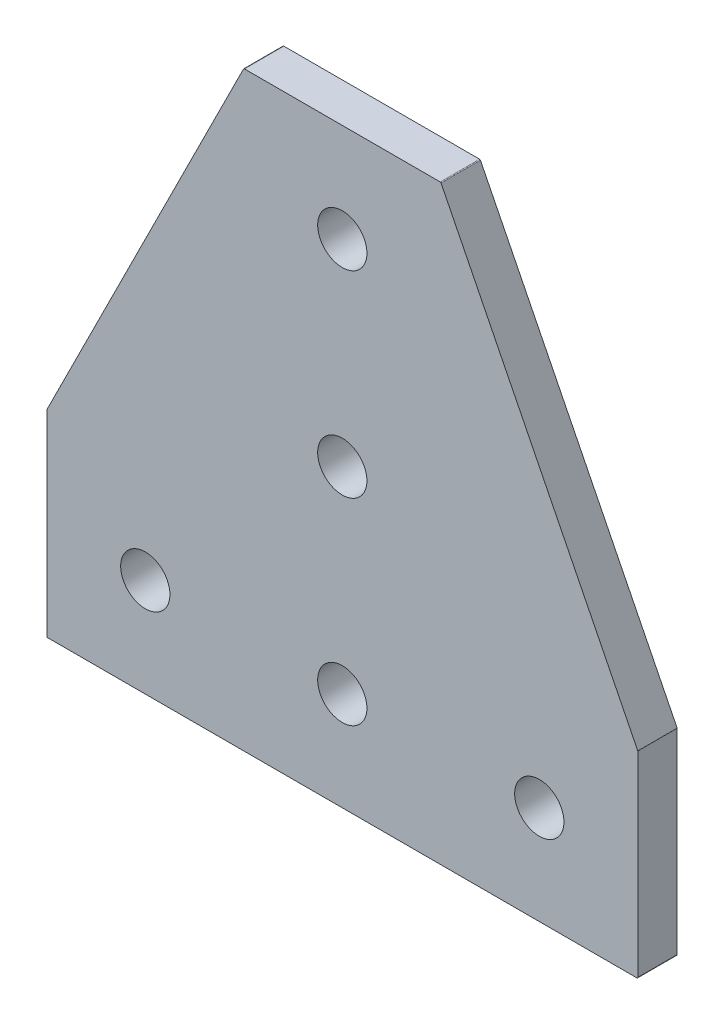
ISO-10303-21;
HEADER;
FILE_DESCRIPTION(('STEP AP214'),'2;1');
FILE_NAME('part.step','',(''),(''),'','','');
FILE_SCHEMA(('AUTOMOTIVE_DESIGN { 1 0 10303 214 1 1 1 1 }'));
ENDSEC;
DATA;
#1=APPLICATION_CONTEXT('core data for automotive mechanical design processes');
#2=APPLICATION_PROTOCOL_DEFINITION('international standard','automotive_design',2000,#1);
#3=PRODUCT_CONTEXT('',#1,'mechanical');
#4=PRODUCT('Part','Part','',(#3));
#5=PRODUCT_RELATED_PRODUCT_CATEGORY('part','',(#4));
#6=PRODUCT_DEFINITION_FORMATION('','',#4);
#7=PRODUCT_DEFINITION_CONTEXT('part definition',#1,'design');
#8=PRODUCT_DEFINITION('design','',#6,#7);
#9=PRODUCT_DEFINITION_SHAPE('','',#8);
#10=(LENGTH_UNIT() NAMED_UNIT(*) SI_UNIT(.MILLI.,.METRE.));
#11=(NAMED_UNIT(*) PLANE_ANGLE_UNIT() SI_UNIT($,.RADIAN.));
#12=(NAMED_UNIT(*) SI_UNIT($,.STERADIAN.) SOLID_ANGLE_UNIT());
#13=UNCERTAINTY_MEASURE_WITH_UNIT(LENGTH_MEASURE(1.E-05),#10,'distance_accuracy_value','');
#14=(GEOMETRIC_REPRESENTATION_CONTEXT(3) GLOBAL_UNCERTAINTY_ASSIGNED_CONTEXT((#13)) GLOBAL_UNIT_ASSIGNED_CONTEXT((#10,
#11,#12)) REPRESENTATION_CONTEXT('',''));
#15=CARTESIAN_POINT('',(0.,0.,0.));
#16=DIRECTION('',(0.,0.,1.));
#17=DIRECTION('',(1.,0.,0.));
#18=AXIS2_PLACEMENT_3D('',#15,#16,#17);
#19=CARTESIAN_POINT('',(0.,0.,-4.));
#20=DIRECTION('',(0.,-1.,0.));
#21=DIRECTION('',(0.,0.,-1.));
#22=AXIS2_PLACEMENT_3D('',#19,#20,#21);
#23=PLANE('',#22);
#24=DIRECTION('',(1.,0.,0.));
#25=VECTOR('',#24,1.);
#26=CARTESIAN_POINT('',(0.,0.,0.));
#27=LINE('',#26,#25);
#28=CARTESIAN_POINT('',(0.1,0.,0.));
#29=VERTEX_POINT('',#28);
#30=CARTESIAN_POINT('',(59.9,0.,0.));
#31=VERTEX_POINT('',#30);
#32=EDGE_CURVE('E213',#29,#31,#27,.T.);
#33=ORIENTED_EDGE('',*,*,#32,.F.);
#34=DIRECTION('',(0.,0.,1.));
#35=VECTOR('',#34,1.);
#36=CARTESIAN_POINT('',(0.1,0.,-4.));
#37=LINE('',#36,#35);
#38=CARTESIAN_POINT('',(0.1,0.,-4.));
#39=VERTEX_POINT('',#38);
#40=EDGE_CURVE('E170',#29,#39,#37,.F.);
#41=ORIENTED_EDGE('',*,*,#40,.T.);
#42=DIRECTION('',(1.,0.,0.));
#43=VECTOR('',#42,1.);
#44=CARTESIAN_POINT('',(0.,0.,-4.));
#45=LINE('',#44,#43);
#46=CARTESIAN_POINT('',(59.9,0.,-4.));
#47=VERTEX_POINT('',#46);
#48=EDGE_CURVE('E146',#39,#47,#45,.T.);
#49=ORIENTED_EDGE('',*,*,#48,.T.);
#50=DIRECTION('',(0.,0.,1.));
#51=VECTOR('',#50,1.);
#52=CARTESIAN_POINT('',(59.9,0.,-4.));
#53=LINE('',#52,#51);
#54=EDGE_CURVE('E167',#47,#31,#53,.T.);
#55=ORIENTED_EDGE('',*,*,#54,.T.);
#56=EDGE_LOOP('',(#33,#41,#49,#55));
#57=FACE_BOUND('',#56,.T.);
#58=ADVANCED_FACE('F34',(#57),#23,.T.);
#59=CARTESIAN_POINT('',(0.,20.,-4.));
#60=DIRECTION('',(-1.,0.,0.));
#61=DIRECTION('',(0.,0.,1.));
#62=AXIS2_PLACEMENT_3D('',#59,#60,#61);
#63=PLANE('',#62);
#64=DIRECTION('',(0.,-1.,0.));
#65=VECTOR('',#64,1.);
#66=CARTESIAN_POINT('',(0.,20.,-4.));
#67=LINE('',#66,#65);
#68=CARTESIAN_POINT('',(0.,19.97639320225,-4.));
#69=VERTEX_POINT('',#68);
#70=CARTESIAN_POINT('',(0.,0.0999999999999994,-4.));
#71=VERTEX_POINT('',#70);
#72=EDGE_CURVE('E218',#69,#71,#67,.T.);
#73=ORIENTED_EDGE('',*,*,#72,.T.);
#74=DIRECTION('',(0.,0.,1.));
#75=VECTOR('',#74,1.);
#76=CARTESIAN_POINT('',(0.,0.0999999999999994,-4.));
#77=LINE('',#76,#75);
#78=CARTESIAN_POINT('',(0.,0.0999999999999994,0.));
#79=VERTEX_POINT('',#78);
#80=EDGE_CURVE('E145',#71,#79,#77,.T.);
#81=ORIENTED_EDGE('',*,*,#80,.T.);
#82=DIRECTION('',(0.,-1.,0.));
#83=VECTOR('',#82,1.);
#84=CARTESIAN_POINT('',(0.,20.,0.));
#85=LINE('',#84,#83);
#86=CARTESIAN_POINT('',(0.,19.97639320225,0.));
#87=VERTEX_POINT('',#86);
#88=EDGE_CURVE('E128',#87,#79,#85,.T.);
#89=ORIENTED_EDGE('',*,*,#88,.F.);
#90=DIRECTION('',(0.,0.,1.));
#91=VECTOR('',#90,1.);
#92=CARTESIAN_POINT('',(0.,19.97639320225,-4.));
#93=LINE('',#92,#91);
#94=EDGE_CURVE('E142',#87,#69,#93,.F.);
#95=ORIENTED_EDGE('',*,*,#94,.T.);
#96=EDGE_LOOP('',(#73,#81,#89,#95));
#97=FACE_BOUND('',#96,.T.);
#98=ADVANCED_FACE('F141',(#97),#63,.T.);
#99=CARTESIAN_POINT('',(20.,60.,-4.));
#100=DIRECTION('',(-0.894427190999916,0.447213595499958,0.));
#101=DIRECTION('',(-0.447213595499958,-0.894427190999916,0.));
#102=AXIS2_PLACEMENT_3D('',#99,#100,#101);
#103=PLANE('',#102);
#104=DIRECTION('',(-0.447213595499958,-0.894427190999916,0.));
#105=VECTOR('',#104,1.);
#106=CARTESIAN_POINT('',(20.,60.,-4.));
#107=LINE('',#106,#105);
#108=CARTESIAN_POINT('',(19.972360679775,59.94472135955,-4.));
#109=VERTEX_POINT('',#108);
#110=CARTESIAN_POINT('',(0.010557280900006,20.0211145618,-4.));
#111=VERTEX_POINT('',#110);
#112=EDGE_CURVE('E221',#109,#111,#107,.T.);
#113=ORIENTED_EDGE('',*,*,#112,.T.);
#114=DIRECTION('',(0.,0.,1.));
#115=VECTOR('',#114,1.);
#116=CARTESIAN_POINT('',(0.0105572809000094,20.0211145618,-4.));
#117=LINE('',#116,#115);
#118=CARTESIAN_POINT('',(0.010557280900006,20.0211145618,0.));
#119=VERTEX_POINT('',#118);
#120=EDGE_CURVE('E184',#111,#119,#117,.T.);
#121=ORIENTED_EDGE('',*,*,#120,.T.);
#122=DIRECTION('',(-0.447213595499958,-0.894427190999916,0.));
#123=VECTOR('',#122,1.);
#124=CARTESIAN_POINT('',(20.,60.,0.));
#125=LINE('',#124,#123);
#126=CARTESIAN_POINT('',(19.972360679775,59.94472135955,0.));
#127=VERTEX_POINT('',#126);
#128=EDGE_CURVE('E130',#127,#119,#125,.T.);
#129=ORIENTED_EDGE('',*,*,#128,.F.);
#130=DIRECTION('',(0.,0.,1.));
#131=VECTOR('',#130,1.);
#132=CARTESIAN_POINT('',(19.972360679775,59.94472135955,-4.));
#133=LINE('',#132,#131);
#134=EDGE_CURVE('E182',#127,#109,#133,.F.);
#135=ORIENTED_EDGE('',*,*,#134,.T.);
#136=EDGE_LOOP('',(#113,#121,#129,#135));
#137=FACE_BOUND('',#136,.T.);
#138=ADVANCED_FACE('F256',(#137),#103,.T.);
#139=CARTESIAN_POINT('',(20.,60.,-4.));
#140=DIRECTION('',(0.,1.,0.));
#141=DIRECTION('',(-1.,0.,0.));
#142=AXIS2_PLACEMENT_3D('',#139,#140,#141);
#143=PLANE('',#142);
#144=DIRECTION('',(-1.,0.,0.));
#145=VECTOR('',#144,1.);
#146=CARTESIAN_POINT('',(20.,60.,-4.));
#147=LINE('',#146,#145);
#148=CARTESIAN_POINT('',(39.938196601125,60.,-4.));
#149=VERTEX_POINT('',#148);
#150=CARTESIAN_POINT('',(20.061803398875,60.,-4.));
#151=VERTEX_POINT('',#150);
#152=EDGE_CURVE('E224',#149,#151,#147,.T.);
#153=ORIENTED_EDGE('',*,*,#152,.T.);
#154=DIRECTION('',(0.,0.,1.));
#155=VECTOR('',#154,1.);
#156=CARTESIAN_POINT('',(20.061803398875,60.,-4.));
#157=LINE('',#156,#155);
#158=CARTESIAN_POINT('',(20.061803398875,60.,0.));
#159=VERTEX_POINT('',#158);
#160=EDGE_CURVE('E188',#151,#159,#157,.T.);
#161=ORIENTED_EDGE('',*,*,#160,.T.);
#162=DIRECTION('',(-1.,0.,0.));
#163=VECTOR('',#162,1.);
#164=CARTESIAN_POINT('',(20.,60.,0.));
#165=LINE('',#164,#163);
#166=CARTESIAN_POINT('',(39.938196601125,60.,0.));
#167=VERTEX_POINT('',#166);
#168=EDGE_CURVE('E209',#167,#159,#165,.T.);
#169=ORIENTED_EDGE('',*,*,#168,.F.);
#170=DIRECTION('',(0.,0.,1.));
#171=VECTOR('',#170,1.);
#172=CARTESIAN_POINT('',(39.938196601125,60.,-4.));
#173=LINE('',#172,#171);
#174=EDGE_CURVE('E186',#167,#149,#173,.F.);
#175=ORIENTED_EDGE('',*,*,#174,.T.);
#176=EDGE_LOOP('',(#153,#161,#169,#175));
#177=FACE_BOUND('',#176,.T.);
#178=ADVANCED_FACE('F249',(#177),#143,.T.);
#179=CARTESIAN_POINT('',(60.,20.,-4.));
#180=DIRECTION('',(0.894427190999916,0.447213595499958,0.));
#181=DIRECTION('',(-0.447213595499958,0.894427190999916,0.));
#182=AXIS2_PLACEMENT_3D('',#179,#180,#181);
#183=PLANE('',#182);
#184=DIRECTION('',(-0.447213595499958,0.894427190999916,0.));
#185=VECTOR('',#184,1.);
#186=CARTESIAN_POINT('',(60.,20.,0.));
#187=LINE('',#186,#185);
#188=CARTESIAN_POINT('',(59.9894427191,20.0211145618,0.));
#189=VERTEX_POINT('',#188);
#190=CARTESIAN_POINT('',(40.027639320225,59.94472135955,0.));
#191=VERTEX_POINT('',#190);
#192=EDGE_CURVE('E201',#189,#191,#187,.T.);
#193=ORIENTED_EDGE('',*,*,#192,.F.);
#194=DIRECTION('',(0.,0.,1.));
#195=VECTOR('',#194,1.);
#196=CARTESIAN_POINT('',(59.9894427191,20.0211145618,-4.));
#197=LINE('',#196,#195);
#198=CARTESIAN_POINT('',(59.9894427191,20.0211145618,-4.));
#199=VERTEX_POINT('',#198);
#200=EDGE_CURVE('E11',#189,#199,#197,.F.);
#201=ORIENTED_EDGE('',*,*,#200,.T.);
#202=DIRECTION('',(-0.447213595499958,0.894427190999916,0.));
#203=VECTOR('',#202,1.);
#204=CARTESIAN_POINT('',(60.,20.,-4.));
#205=LINE('',#204,#203);
#206=CARTESIAN_POINT('',(40.027639320225,59.94472135955,-4.));
#207=VERTEX_POINT('',#206);
#208=EDGE_CURVE('E203',#199,#207,#205,.T.);
#209=ORIENTED_EDGE('',*,*,#208,.T.);
#210=DIRECTION('',(0.,0.,1.));
#211=VECTOR('',#210,1.);
#212=CARTESIAN_POINT('',(40.027639320225,59.94472135955,-4.));
#213=LINE('',#212,#211);
#214=EDGE_CURVE('E42',#207,#191,#213,.T.);
#215=ORIENTED_EDGE('',*,*,#214,.T.);
#216=EDGE_LOOP('',(#193,#201,#209,#215));
#217=FACE_BOUND('',#216,.T.);
#218=ADVANCED_FACE('F200',(#217),#183,.T.);
#219=CARTESIAN_POINT('',(60.,0.,-4.));
#220=DIRECTION('',(1.,0.,0.));
#221=DIRECTION('',(0.,1.,0.));
#222=AXIS2_PLACEMENT_3D('',#219,#220,#221);
#223=PLANE('',#222);
#224=DIRECTION('',(0.,1.,0.));
#225=VECTOR('',#224,1.);
#226=CARTESIAN_POINT('',(60.,0.,0.));
#227=LINE('',#226,#225);
#228=CARTESIAN_POINT('',(60.,0.1,0.));
#229=VERTEX_POINT('',#228);
#230=CARTESIAN_POINT('',(60.,19.97639320225,0.));
#231=VERTEX_POINT('',#230);
#232=EDGE_CURVE('E210',#229,#231,#227,.T.);
#233=ORIENTED_EDGE('',*,*,#232,.F.);
#234=DIRECTION('',(0.,0.,1.));
#235=VECTOR('',#234,1.);
#236=CARTESIAN_POINT('',(60.,0.1,-4.));
#237=LINE('',#236,#235);
#238=CARTESIAN_POINT('',(60.,0.1,-4.));
#239=VERTEX_POINT('',#238);
#240=EDGE_CURVE('E56',#229,#239,#237,.F.);
#241=ORIENTED_EDGE('',*,*,#240,.T.);
#242=DIRECTION('',(0.,1.,0.));
#243=VECTOR('',#242,1.);
#244=CARTESIAN_POINT('',(60.,0.,-4.));
#245=LINE('',#244,#243);
#246=CARTESIAN_POINT('',(60.,19.97639320225,-4.));
#247=VERTEX_POINT('',#246);
#248=EDGE_CURVE('E243',#239,#247,#245,.T.);
#249=ORIENTED_EDGE('',*,*,#248,.T.);
#250=DIRECTION('',(0.,0.,1.));
#251=VECTOR('',#250,1.);
#252=CARTESIAN_POINT('',(60.,19.97639320225,-4.));
#253=LINE('',#252,#251);
#254=EDGE_CURVE('E191',#247,#231,#253,.T.);
#255=ORIENTED_EDGE('',*,*,#254,.T.);
#256=EDGE_LOOP('',(#233,#241,#249,#255));
#257=FACE_BOUND('',#256,.T.);
#258=ADVANCED_FACE('F269',(#257),#223,.T.);
#259=CARTESIAN_POINT('',(0.,0.,-4.));
#260=DIRECTION('',(0.,0.,1.));
#261=DIRECTION('',(1.,0.,0.));
#262=AXIS2_PLACEMENT_3D('',#259,#260,#261);
#263=PLANE('',#262);
#264=CARTESIAN_POINT('',(50.,10.,-4.));
#265=DIRECTION('',(0.,0.,1.));
#266=DIRECTION('',(1.,0.,0.));
#267=AXIS2_PLACEMENT_3D('',#264,#265,#266);
#268=CIRCLE('',#267,2.5);
#269=CARTESIAN_POINT('',(52.5,10.,-4.));
#270=VERTEX_POINT('',#269);
#271=EDGE_CURVE('E438',#270,#270,#268,.T.);
#272=ORIENTED_EDGE('',*,*,#271,.T.);
#273=EDGE_LOOP('',(#272));
#274=FACE_BOUND('',#273,.T.);
#275=CARTESIAN_POINT('',(10.,10.,-4.));
#276=DIRECTION('',(0.,0.,1.));
#277=DIRECTION('',(1.,0.,0.));
#278=AXIS2_PLACEMENT_3D('',#275,#276,#277);
#279=CIRCLE('',#278,2.5);
#280=CARTESIAN_POINT('',(12.5,10.,-4.));
#281=VERTEX_POINT('',#280);
#282=EDGE_CURVE('E442',#281,#281,#279,.T.);
#283=ORIENTED_EDGE('',*,*,#282,.T.);
#284=EDGE_LOOP('',(#283));
#285=FACE_BOUND('',#284,.T.);
#286=CARTESIAN_POINT('',(30.,30.,-4.));
#287=DIRECTION('',(0.,0.,1.));
#288=DIRECTION('',(1.,0.,0.));
#289=AXIS2_PLACEMENT_3D('',#286,#287,#288);
#290=CIRCLE('',#289,2.5);
#291=CARTESIAN_POINT('',(32.5,30.,-4.));
#292=VERTEX_POINT('',#291);
#293=EDGE_CURVE('E445',#292,#292,#290,.T.);
#294=ORIENTED_EDGE('',*,*,#293,.T.);
#295=EDGE_LOOP('',(#294));
#296=FACE_BOUND('',#295,.T.);
#297=CARTESIAN_POINT('',(30.,10.,-4.));
#298=DIRECTION('',(0.,0.,1.));
#299=DIRECTION('',(1.,0.,0.));
#300=AXIS2_PLACEMENT_3D('',#297,#298,#299);
#301=CIRCLE('',#300,2.5);
#302=CARTESIAN_POINT('',(32.5,10.,-4.));
#303=VERTEX_POINT('',#302);
#304=EDGE_CURVE('E228',#303,#303,#301,.T.);
#305=ORIENTED_EDGE('',*,*,#304,.T.);
#306=EDGE_LOOP('',(#305));
#307=FACE_BOUND('',#306,.T.);
#308=ORIENTED_EDGE('',*,*,#48,.F.);
#309=CARTESIAN_POINT('',(0.1,0.0999999999999994,-4.));
#310=DIRECTION('',(0.,0.,1.));
#311=DIRECTION('',(1.,0.,0.));
#312=AXIS2_PLACEMENT_3D('',#309,#310,#311);
#313=CIRCLE('',#312,0.1);
#314=EDGE_CURVE('E180',#39,#71,#313,.F.);
#315=ORIENTED_EDGE('',*,*,#314,.T.);
#316=ORIENTED_EDGE('',*,*,#72,.F.);
#317=CARTESIAN_POINT('',(0.0999999999999994,19.97639320225,-4.));
#318=DIRECTION('',(0.,0.,1.));
#319=DIRECTION('',(1.,0.,0.));
#320=AXIS2_PLACEMENT_3D('',#317,#318,#319);
#321=CIRCLE('',#320,0.1);
#322=EDGE_CURVE('E150',#69,#111,#321,.F.);
#323=ORIENTED_EDGE('',*,*,#322,.T.);
#324=ORIENTED_EDGE('',*,*,#112,.F.);
#325=CARTESIAN_POINT('',(20.061803398875,59.9,-4.));
#326=DIRECTION('',(0.,0.,1.));
#327=DIRECTION('',(1.,0.,0.));
#328=AXIS2_PLACEMENT_3D('',#325,#326,#327);
#329=CIRCLE('',#328,0.1);
#330=EDGE_CURVE('E177',#109,#151,#329,.F.);
#331=ORIENTED_EDGE('',*,*,#330,.T.);
#332=ORIENTED_EDGE('',*,*,#152,.F.);
#333=CARTESIAN_POINT('',(39.938196601125,59.9,-4.));
#334=DIRECTION('',(0.,0.,1.));
#335=DIRECTION('',(1.,0.,0.));
#336=AXIS2_PLACEMENT_3D('',#333,#334,#335);
#337=CIRCLE('',#336,0.1);
#338=EDGE_CURVE('E172',#149,#207,#337,.F.);
#339=ORIENTED_EDGE('',*,*,#338,.T.);
#340=ORIENTED_EDGE('',*,*,#208,.F.);
#341=CARTESIAN_POINT('',(59.9,19.97639320225,-4.));
#342=DIRECTION('',(0.,0.,1.));
#343=DIRECTION('',(1.,0.,0.));
#344=AXIS2_PLACEMENT_3D('',#341,#342,#343);
#345=CIRCLE('',#344,0.1);
#346=EDGE_CURVE('E49',#199,#247,#345,.F.);
#347=ORIENTED_EDGE('',*,*,#346,.T.);
#348=ORIENTED_EDGE('',*,*,#248,.F.);
#349=CARTESIAN_POINT('',(59.9,0.1,-4.));
#350=DIRECTION('',(0.,0.,1.));
#351=DIRECTION('',(1.,0.,0.));
#352=AXIS2_PLACEMENT_3D('',#349,#350,#351);
#353=CIRCLE('',#352,0.1);
#354=EDGE_CURVE('E175',#239,#47,#353,.F.);
#355=ORIENTED_EDGE('',*,*,#354,.T.);
#356=EDGE_LOOP('',(#308,#315,#316,#323,#324,#331,#332,#339,#340,#347,#348,#355));
#357=FACE_BOUND('',#356,.T.);
#358=CARTESIAN_POINT('',(30.,50.,-4.));
#359=DIRECTION('',(0.,0.,1.));
#360=DIRECTION('',(1.,0.,0.));
#361=AXIS2_PLACEMENT_3D('',#358,#359,#360);
#362=CIRCLE('',#361,2.5);
#363=CARTESIAN_POINT('',(32.5,50.,-4.));
#364=VERTEX_POINT('',#363);
#365=EDGE_CURVE('E156',#364,#364,#362,.T.);
#366=ORIENTED_EDGE('',*,*,#365,.T.);
#367=EDGE_LOOP('',(#366));
#368=FACE_BOUND('',#367,.T.);
#369=ADVANCED_FACE('F259',(#274,#285,#296,#307,#357,#368),#263,.F.);
#370=CARTESIAN_POINT('',(0.,0.,0.));
#371=DIRECTION('',(0.,0.,1.));
#372=DIRECTION('',(1.,0.,0.));
#373=AXIS2_PLACEMENT_3D('',#370,#371,#372);
#374=PLANE('',#373);
#375=CARTESIAN_POINT('',(50.,10.,0.));
#376=DIRECTION('',(0.,0.,1.));
#377=DIRECTION('',(1.,0.,0.));
#378=AXIS2_PLACEMENT_3D('',#375,#376,#377);
#379=CIRCLE('',#378,2.5);
#380=CARTESIAN_POINT('',(52.5,10.,0.));
#381=VERTEX_POINT('',#380);
#382=EDGE_CURVE('E452',#381,#381,#379,.T.);
#383=ORIENTED_EDGE('',*,*,#382,.F.);
#384=EDGE_LOOP('',(#383));
#385=FACE_BOUND('',#384,.T.);
#386=CARTESIAN_POINT('',(10.,10.,0.));
#387=DIRECTION('',(0.,0.,1.));
#388=DIRECTION('',(1.,0.,0.));
#389=AXIS2_PLACEMENT_3D('',#386,#387,#388);
#390=CIRCLE('',#389,2.5);
#391=CARTESIAN_POINT('',(12.5,10.,0.));
#392=VERTEX_POINT('',#391);
#393=EDGE_CURVE('E447',#392,#392,#390,.T.);
#394=ORIENTED_EDGE('',*,*,#393,.F.);
#395=EDGE_LOOP('',(#394));
#396=FACE_BOUND('',#395,.T.);
#397=CARTESIAN_POINT('',(30.,30.,0.));
#398=DIRECTION('',(0.,0.,1.));
#399=DIRECTION('',(1.,0.,0.));
#400=AXIS2_PLACEMENT_3D('',#397,#398,#399);
#401=CIRCLE('',#400,2.5);
#402=CARTESIAN_POINT('',(32.5,30.,0.));
#403=VERTEX_POINT('',#402);
#404=EDGE_CURVE('E236',#403,#403,#401,.T.);
#405=ORIENTED_EDGE('',*,*,#404,.F.);
#406=EDGE_LOOP('',(#405));
#407=FACE_BOUND('',#406,.T.);
#408=CARTESIAN_POINT('',(30.,10.,0.));
#409=DIRECTION('',(0.,0.,1.));
#410=DIRECTION('',(1.,0.,0.));
#411=AXIS2_PLACEMENT_3D('',#408,#409,#410);
#412=CIRCLE('',#411,2.5);
#413=CARTESIAN_POINT('',(32.5,10.,0.));
#414=VERTEX_POINT('',#413);
#415=EDGE_CURVE('E231',#414,#414,#412,.T.);
#416=ORIENTED_EDGE('',*,*,#415,.F.);
#417=EDGE_LOOP('',(#416));
#418=FACE_BOUND('',#417,.T.);
#419=ORIENTED_EDGE('',*,*,#88,.T.);
#420=CARTESIAN_POINT('',(0.1,0.0999999999999994,0.));
#421=DIRECTION('',(0.,0.,1.));
#422=DIRECTION('',(1.,0.,0.));
#423=AXIS2_PLACEMENT_3D('',#420,#421,#422);
#424=CIRCLE('',#423,0.1);
#425=EDGE_CURVE('E135',#79,#29,#424,.T.);
#426=ORIENTED_EDGE('',*,*,#425,.T.);
#427=ORIENTED_EDGE('',*,*,#32,.T.);
#428=CARTESIAN_POINT('',(59.9,0.1,0.));
#429=DIRECTION('',(0.,0.,1.));
#430=DIRECTION('',(1.,0.,0.));
#431=AXIS2_PLACEMENT_3D('',#428,#429,#430);
#432=CIRCLE('',#431,0.1);
#433=EDGE_CURVE('E163',#31,#229,#432,.T.);
#434=ORIENTED_EDGE('',*,*,#433,.T.);
#435=ORIENTED_EDGE('',*,*,#232,.T.);
#436=CARTESIAN_POINT('',(59.9,19.97639320225,0.));
#437=DIRECTION('',(0.,0.,1.));
#438=DIRECTION('',(1.,0.,0.));
#439=AXIS2_PLACEMENT_3D('',#436,#437,#438);
#440=CIRCLE('',#439,0.1);
#441=EDGE_CURVE('E161',#231,#189,#440,.T.);
#442=ORIENTED_EDGE('',*,*,#441,.T.);
#443=ORIENTED_EDGE('',*,*,#192,.T.);
#444=CARTESIAN_POINT('',(39.938196601125,59.9,0.));
#445=DIRECTION('',(0.,0.,1.));
#446=DIRECTION('',(1.,0.,0.));
#447=AXIS2_PLACEMENT_3D('',#444,#445,#446);
#448=CIRCLE('',#447,0.1);
#449=EDGE_CURVE('E153',#191,#167,#448,.T.);
#450=ORIENTED_EDGE('',*,*,#449,.T.);
#451=ORIENTED_EDGE('',*,*,#168,.T.);
#452=CARTESIAN_POINT('',(20.061803398875,59.9,0.));
#453=DIRECTION('',(0.,0.,1.));
#454=DIRECTION('',(1.,0.,0.));
#455=AXIS2_PLACEMENT_3D('',#452,#453,#454);
#456=CIRCLE('',#455,0.1);
#457=EDGE_CURVE('E136',#159,#127,#456,.T.);
#458=ORIENTED_EDGE('',*,*,#457,.T.);
#459=ORIENTED_EDGE('',*,*,#128,.T.);
#460=CARTESIAN_POINT('',(0.0999999999999994,19.97639320225,0.));
#461=DIRECTION('',(0.,0.,1.));
#462=DIRECTION('',(1.,0.,0.));
#463=AXIS2_PLACEMENT_3D('',#460,#461,#462);
#464=CIRCLE('',#463,0.1);
#465=EDGE_CURVE('E124',#119,#87,#464,.T.);
#466=ORIENTED_EDGE('',*,*,#465,.T.);
#467=EDGE_LOOP('',(#419,#426,#427,#434,#435,#442,#443,#450,#451,#458,#459,#466));
#468=FACE_BOUND('',#467,.T.);
#469=CARTESIAN_POINT('',(30.,50.,0.));
#470=DIRECTION('',(0.,0.,1.));
#471=DIRECTION('',(1.,0.,0.));
#472=AXIS2_PLACEMENT_3D('',#469,#470,#471);
#473=CIRCLE('',#472,2.5);
#474=CARTESIAN_POINT('',(32.5,50.,0.));
#475=VERTEX_POINT('',#474);
#476=EDGE_CURVE('E151',#475,#475,#473,.T.);
#477=ORIENTED_EDGE('',*,*,#476,.F.);
#478=EDGE_LOOP('',(#477));
#479=FACE_BOUND('',#478,.T.);
#480=ADVANCED_FACE('F126',(#385,#396,#407,#418,#468,#479),#374,.T.);
#481=CARTESIAN_POINT('',(30.,10.,-4.));
#482=DIRECTION('',(0.,0.,1.));
#483=DIRECTION('',(1.,0.,0.));
#484=AXIS2_PLACEMENT_3D('',#481,#482,#483);
#485=CYLINDRICAL_SURFACE('',#484,2.5);
#486=ORIENTED_EDGE('',*,*,#304,.F.);
#487=EDGE_LOOP('',(#486));
#488=FACE_BOUND('',#487,.T.);
#489=ORIENTED_EDGE('',*,*,#415,.T.);
#490=EDGE_LOOP('',(#489));
#491=FACE_BOUND('',#490,.T.);
#492=ADVANCED_FACE('F360',(#488,#491),#485,.F.);
#493=CARTESIAN_POINT('',(30.,30.,-4.));
#494=DIRECTION('',(0.,0.,1.));
#495=DIRECTION('',(1.,0.,0.));
#496=AXIS2_PLACEMENT_3D('',#493,#494,#495);
#497=CYLINDRICAL_SURFACE('',#496,2.5);
#498=ORIENTED_EDGE('',*,*,#293,.F.);
#499=EDGE_LOOP('',(#498));
#500=FACE_BOUND('',#499,.T.);
#501=ORIENTED_EDGE('',*,*,#404,.T.);
#502=EDGE_LOOP('',(#501));
#503=FACE_BOUND('',#502,.T.);
#504=ADVANCED_FACE('F290',(#500,#503),#497,.F.);
#505=CARTESIAN_POINT('',(30.,50.,-4.));
#506=DIRECTION('',(0.,0.,1.));
#507=DIRECTION('',(1.,0.,0.));
#508=AXIS2_PLACEMENT_3D('',#505,#506,#507);
#509=CYLINDRICAL_SURFACE('',#508,2.5);
#510=ORIENTED_EDGE('',*,*,#365,.F.);
#511=EDGE_LOOP('',(#510));
#512=FACE_BOUND('',#511,.T.);
#513=ORIENTED_EDGE('',*,*,#476,.T.);
#514=EDGE_LOOP('',(#513));
#515=FACE_BOUND('',#514,.T.);
#516=ADVANCED_FACE('F286',(#512,#515),#509,.F.);
#517=CARTESIAN_POINT('',(10.,10.,-4.));
#518=DIRECTION('',(0.,0.,1.));
#519=DIRECTION('',(1.,0.,0.));
#520=AXIS2_PLACEMENT_3D('',#517,#518,#519);
#521=CYLINDRICAL_SURFACE('',#520,2.5);
#522=ORIENTED_EDGE('',*,*,#282,.F.);
#523=EDGE_LOOP('',(#522));
#524=FACE_BOUND('',#523,.T.);
#525=ORIENTED_EDGE('',*,*,#393,.T.);
#526=EDGE_LOOP('',(#525));
#527=FACE_BOUND('',#526,.T.);
#528=ADVANCED_FACE('F289',(#524,#527),#521,.F.);
#529=CARTESIAN_POINT('',(50.,10.,-4.));
#530=DIRECTION('',(0.,0.,1.));
#531=DIRECTION('',(1.,0.,0.));
#532=AXIS2_PLACEMENT_3D('',#529,#530,#531);
#533=CYLINDRICAL_SURFACE('',#532,2.5);
#534=ORIENTED_EDGE('',*,*,#271,.F.);
#535=EDGE_LOOP('',(#534));
#536=FACE_BOUND('',#535,.T.);
#537=ORIENTED_EDGE('',*,*,#382,.T.);
#538=EDGE_LOOP('',(#537));
#539=FACE_BOUND('',#538,.T.);
#540=ADVANCED_FACE('F294',(#536,#539),#533,.F.);
#541=CARTESIAN_POINT('',(0.1,0.0999999999999994,-4.));
#542=DIRECTION('',(0.,0.,1.));
#543=DIRECTION('',(1.,0.,0.));
#544=AXIS2_PLACEMENT_3D('',#541,#542,#543);
#545=CYLINDRICAL_SURFACE('',#544,0.1);
#546=ORIENTED_EDGE('',*,*,#314,.F.);
#547=ORIENTED_EDGE('',*,*,#40,.F.);
#548=ORIENTED_EDGE('',*,*,#425,.F.);
#549=ORIENTED_EDGE('',*,*,#80,.F.);
#550=EDGE_LOOP('',(#546,#547,#548,#549));
#551=FACE_BOUND('',#550,.T.);
#552=ADVANCED_FACE('F263',(#551),#545,.T.);
#553=CARTESIAN_POINT('',(0.0999999999999994,19.97639320225,-4.));
#554=DIRECTION('',(0.,0.,1.));
#555=DIRECTION('',(1.,0.,0.));
#556=AXIS2_PLACEMENT_3D('',#553,#554,#555);
#557=CYLINDRICAL_SURFACE('',#556,0.1);
#558=ORIENTED_EDGE('',*,*,#322,.F.);
#559=ORIENTED_EDGE('',*,*,#94,.F.);
#560=ORIENTED_EDGE('',*,*,#465,.F.);
#561=ORIENTED_EDGE('',*,*,#120,.F.);
#562=EDGE_LOOP('',(#558,#559,#560,#561));
#563=FACE_BOUND('',#562,.T.);
#564=ADVANCED_FACE('F149',(#563),#557,.T.);
#565=CARTESIAN_POINT('',(20.061803398875,59.9,-4.));
#566=DIRECTION('',(0.,0.,1.));
#567=DIRECTION('',(1.,0.,0.));
#568=AXIS2_PLACEMENT_3D('',#565,#566,#567);
#569=CYLINDRICAL_SURFACE('',#568,0.1);
#570=ORIENTED_EDGE('',*,*,#330,.F.);
#571=ORIENTED_EDGE('',*,*,#134,.F.);
#572=ORIENTED_EDGE('',*,*,#457,.F.);
#573=ORIENTED_EDGE('',*,*,#160,.F.);
#574=EDGE_LOOP('',(#570,#571,#572,#573));
#575=FACE_BOUND('',#574,.T.);
#576=ADVANCED_FACE('F253',(#575),#569,.T.);
#577=CARTESIAN_POINT('',(59.9,0.1,-4.));
#578=DIRECTION('',(0.,0.,1.));
#579=DIRECTION('',(1.,0.,0.));
#580=AXIS2_PLACEMENT_3D('',#577,#578,#579);
#581=CYLINDRICAL_SURFACE('',#580,0.1);
#582=ORIENTED_EDGE('',*,*,#354,.F.);
#583=ORIENTED_EDGE('',*,*,#240,.F.);
#584=ORIENTED_EDGE('',*,*,#433,.F.);
#585=ORIENTED_EDGE('',*,*,#54,.F.);
#586=EDGE_LOOP('',(#582,#583,#584,#585));
#587=FACE_BOUND('',#586,.T.);
#588=ADVANCED_FACE('F268',(#587),#581,.T.);
#589=CARTESIAN_POINT('',(59.9,19.97639320225,-4.));
#590=DIRECTION('',(0.,0.,1.));
#591=DIRECTION('',(1.,0.,0.));
#592=AXIS2_PLACEMENT_3D('',#589,#590,#591);
#593=CYLINDRICAL_SURFACE('',#592,0.1);
#594=ORIENTED_EDGE('',*,*,#346,.F.);
#595=ORIENTED_EDGE('',*,*,#200,.F.);
#596=ORIENTED_EDGE('',*,*,#441,.F.);
#597=ORIENTED_EDGE('',*,*,#254,.F.);
#598=EDGE_LOOP('',(#594,#595,#596,#597));
#599=FACE_BOUND('',#598,.T.);
#600=ADVANCED_FACE('F272',(#599),#593,.T.);
#601=CARTESIAN_POINT('',(39.938196601125,59.9,-4.));
#602=DIRECTION('',(0.,0.,1.));
#603=DIRECTION('',(1.,0.,0.));
#604=AXIS2_PLACEMENT_3D('',#601,#602,#603);
#605=CYLINDRICAL_SURFACE('',#604,0.1);
#606=ORIENTED_EDGE('',*,*,#338,.F.);
#607=ORIENTED_EDGE('',*,*,#174,.F.);
#608=ORIENTED_EDGE('',*,*,#449,.F.);
#609=ORIENTED_EDGE('',*,*,#214,.F.);
#610=EDGE_LOOP('',(#606,#607,#608,#609));
#611=FACE_BOUND('',#610,.T.);
#612=ADVANCED_FACE('F36',(#611),#605,.T.);
#613=CLOSED_SHELL('',(#58,#98,#138,#178,#218,#258,#369,#480,#492,#504,#516,#528,#540,#552,#564,
#576,#588,#600,#612));
#614=MANIFOLD_SOLID_BREP('B2',#613);
#615=ADVANCED_BREP_SHAPE_REPRESENTATION('',(#18,#614),#14);
#616=SHAPE_DEFINITION_REPRESENTATION(#9,#615);
ENDSEC;
END-ISO-10303-21;
